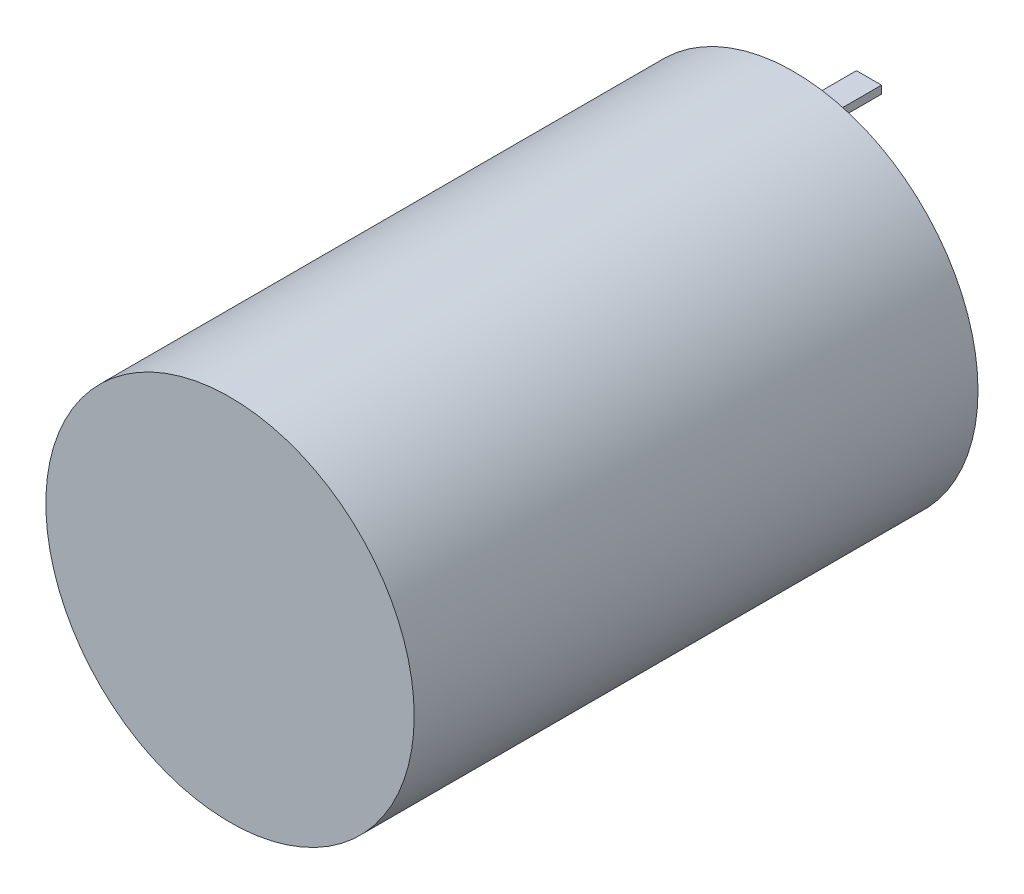
ISO-10303-21;
HEADER;
FILE_DESCRIPTION(('STEP AP214'),'2;1');
FILE_NAME('part.step','',(''),(''),'','','');
FILE_SCHEMA(('AUTOMOTIVE_DESIGN { 1 0 10303 214 1 1 1 1 }'));
ENDSEC;
DATA;
#1=APPLICATION_CONTEXT('core data for automotive mechanical design processes');
#2=APPLICATION_PROTOCOL_DEFINITION('international standard','automotive_design',2000,#1);
#3=PRODUCT_CONTEXT('',#1,'mechanical');
#4=PRODUCT('Part','Part','',(#3));
#5=PRODUCT_RELATED_PRODUCT_CATEGORY('part','',(#4));
#6=PRODUCT_DEFINITION_FORMATION('','',#4);
#7=PRODUCT_DEFINITION_CONTEXT('part definition',#1,'design');
#8=PRODUCT_DEFINITION('design','',#6,#7);
#9=PRODUCT_DEFINITION_SHAPE('','',#8);
#10=(LENGTH_UNIT() NAMED_UNIT(*) SI_UNIT(.MILLI.,.METRE.));
#11=(NAMED_UNIT(*) PLANE_ANGLE_UNIT() SI_UNIT($,.RADIAN.));
#12=(NAMED_UNIT(*) SI_UNIT($,.STERADIAN.) SOLID_ANGLE_UNIT());
#13=UNCERTAINTY_MEASURE_WITH_UNIT(LENGTH_MEASURE(1.E-05),#10,'distance_accuracy_value','');
#14=(GEOMETRIC_REPRESENTATION_CONTEXT(3) GLOBAL_UNCERTAINTY_ASSIGNED_CONTEXT((#13)) GLOBAL_UNIT_ASSIGNED_CONTEXT((#10,
#11,#12)) REPRESENTATION_CONTEXT('',''));
#15=CARTESIAN_POINT('',(0.,0.,0.));
#16=DIRECTION('',(0.,0.,1.));
#17=DIRECTION('',(1.,0.,0.));
#18=AXIS2_PLACEMENT_3D('',#15,#16,#17);
#19=CARTESIAN_POINT('',(0.,0.,57.15));
#20=DIRECTION('',(0.,0.,-1.));
#21=DIRECTION('',(-1.,0.,0.));
#22=AXIS2_PLACEMENT_3D('',#19,#20,#21);
#23=CYLINDRICAL_SURFACE('',#22,18.669);
#24=CARTESIAN_POINT('',(0.,0.,57.15));
#25=DIRECTION('',(0.,0.,1.));
#26=DIRECTION('',(1.,0.,0.));
#27=AXIS2_PLACEMENT_3D('',#24,#25,#26);
#28=CIRCLE('',#27,18.669);
#29=CARTESIAN_POINT('',(18.669,0.,57.15));
#30=VERTEX_POINT('',#29);
#31=EDGE_CURVE('E13',#30,#30,#28,.T.);
#32=ORIENTED_EDGE('',*,*,#31,.F.);
#33=EDGE_LOOP('',(#32));
#34=FACE_BOUND('',#33,.T.);
#35=CARTESIAN_POINT('',(0.,0.,0.));
#36=DIRECTION('',(0.,0.,1.));
#37=DIRECTION('',(1.,0.,0.));
#38=AXIS2_PLACEMENT_3D('',#35,#36,#37);
#39=CIRCLE('',#38,18.669);
#40=CARTESIAN_POINT('',(18.669,0.,0.));
#41=VERTEX_POINT('',#40);
#42=EDGE_CURVE('E52',#41,#41,#39,.T.);
#43=ORIENTED_EDGE('',*,*,#42,.T.);
#44=EDGE_LOOP('',(#43));
#45=FACE_BOUND('',#44,.T.);
#46=ADVANCED_FACE('F49',(#34,#45),#23,.T.);
#47=CARTESIAN_POINT('',(0.,0.,57.15));
#48=DIRECTION('',(0.,0.,1.));
#49=DIRECTION('',(1.,0.,0.));
#50=AXIS2_PLACEMENT_3D('',#47,#48,#49);
#51=PLANE('',#50);
#52=ORIENTED_EDGE('',*,*,#31,.T.);
#53=EDGE_LOOP('',(#52));
#54=FACE_BOUND('',#53,.T.);
#55=ADVANCED_FACE('F190',(#54),#51,.T.);
#56=CARTESIAN_POINT('',(0.,0.,0.));
#57=DIRECTION('',(0.,0.,1.));
#58=DIRECTION('',(1.,0.,0.));
#59=AXIS2_PLACEMENT_3D('',#56,#57,#58);
#60=PLANE('',#59);
#61=DIRECTION('',(-1.,0.,0.));
#62=VECTOR('',#61,1.);
#63=CARTESIAN_POINT('',(0.,-13.509625,0.));
#64=LINE('',#63,#62);
#65=CARTESIAN_POINT('',(1.27,-13.509625,0.));
#66=VERTEX_POINT('',#65);
#67=CARTESIAN_POINT('',(-1.27,-13.509625,0.));
#68=VERTEX_POINT('',#67);
#69=EDGE_CURVE('E63',#66,#68,#64,.T.);
#70=ORIENTED_EDGE('',*,*,#69,.T.);
#71=DIRECTION('',(0.,-1.,0.));
#72=VECTOR('',#71,1.);
#73=CARTESIAN_POINT('',(-1.26999999999999,0.,0.));
#74=LINE('',#73,#72);
#75=CARTESIAN_POINT('',(-1.27,-14.303375,0.));
#76=VERTEX_POINT('',#75);
#77=EDGE_CURVE('E117',#68,#76,#74,.T.);
#78=ORIENTED_EDGE('',*,*,#77,.T.);
#79=DIRECTION('',(-1.,0.,0.));
#80=VECTOR('',#79,1.);
#81=CARTESIAN_POINT('',(0.,-14.303375,0.));
#82=LINE('',#81,#80);
#83=CARTESIAN_POINT('',(1.27,-14.303375,0.));
#84=VERTEX_POINT('',#83);
#85=EDGE_CURVE('E130',#84,#76,#82,.T.);
#86=ORIENTED_EDGE('',*,*,#85,.F.);
#87=DIRECTION('',(0.,-1.,0.));
#88=VECTOR('',#87,1.);
#89=CARTESIAN_POINT('',(1.27,0.,0.));
#90=LINE('',#89,#88);
#91=EDGE_CURVE('E68',#66,#84,#90,.T.);
#92=ORIENTED_EDGE('',*,*,#91,.F.);
#93=EDGE_LOOP('',(#70,#78,#86,#92));
#94=FACE_BOUND('',#93,.T.);
#95=DIRECTION('',(-1.,0.,0.));
#96=VECTOR('',#95,1.);
#97=CARTESIAN_POINT('',(0.,14.303375,0.));
#98=LINE('',#97,#96);
#99=CARTESIAN_POINT('',(1.27,14.303375,0.));
#100=VERTEX_POINT('',#99);
#101=CARTESIAN_POINT('',(-1.27,14.303375,0.));
#102=VERTEX_POINT('',#101);
#103=EDGE_CURVE('E163',#100,#102,#98,.T.);
#104=ORIENTED_EDGE('',*,*,#103,.T.);
#105=DIRECTION('',(0.,-1.,0.));
#106=VECTOR('',#105,1.);
#107=CARTESIAN_POINT('',(-1.27,0.,0.));
#108=LINE('',#107,#106);
#109=CARTESIAN_POINT('',(-1.27,13.509625,0.));
#110=VERTEX_POINT('',#109);
#111=EDGE_CURVE('E120',#102,#110,#108,.T.);
#112=ORIENTED_EDGE('',*,*,#111,.T.);
#113=DIRECTION('',(-1.,0.,0.));
#114=VECTOR('',#113,1.);
#115=CARTESIAN_POINT('',(0.,13.509625,0.));
#116=LINE('',#115,#114);
#117=CARTESIAN_POINT('',(1.27,13.509625,0.));
#118=VERTEX_POINT('',#117);
#119=EDGE_CURVE('E154',#118,#110,#116,.T.);
#120=ORIENTED_EDGE('',*,*,#119,.F.);
#121=DIRECTION('',(0.,-1.,0.));
#122=VECTOR('',#121,1.);
#123=CARTESIAN_POINT('',(1.27,0.,0.));
#124=LINE('',#123,#122);
#125=EDGE_CURVE('E165',#100,#118,#124,.T.);
#126=ORIENTED_EDGE('',*,*,#125,.F.);
#127=EDGE_LOOP('',(#104,#112,#120,#126));
#128=FACE_BOUND('',#127,.T.);
#129=ORIENTED_EDGE('',*,*,#42,.F.);
#130=EDGE_LOOP('',(#129));
#131=FACE_BOUND('',#130,.T.);
#132=ADVANCED_FACE('F187',(#94,#128,#131),#60,.F.);
#133=CARTESIAN_POINT('',(-1.27,0.,-7.62));
#134=DIRECTION('',(-1.,0.,0.));
#135=DIRECTION('',(0.,0.,1.));
#136=AXIS2_PLACEMENT_3D('',#133,#134,#135);
#137=PLANE('',#136);
#138=ORIENTED_EDGE('',*,*,#111,.F.);
#139=DIRECTION('',(0.,0.,1.));
#140=VECTOR('',#139,1.);
#141=CARTESIAN_POINT('',(-1.27,14.303375,-7.62));
#142=LINE('',#141,#140);
#143=CARTESIAN_POINT('',(-1.27,14.303375,-7.62));
#144=VERTEX_POINT('',#143);
#145=EDGE_CURVE('E178',#144,#102,#142,.T.);
#146=ORIENTED_EDGE('',*,*,#145,.F.);
#147=DIRECTION('',(0.,-1.,0.));
#148=VECTOR('',#147,1.);
#149=CARTESIAN_POINT('',(-1.27,0.,-7.62));
#150=LINE('',#149,#148);
#151=CARTESIAN_POINT('',(-1.27,13.509625,-7.62));
#152=VERTEX_POINT('',#151);
#153=EDGE_CURVE('E150',#144,#152,#150,.T.);
#154=ORIENTED_EDGE('',*,*,#153,.T.);
#155=DIRECTION('',(0.,0.,1.));
#156=VECTOR('',#155,1.);
#157=CARTESIAN_POINT('',(-1.27,13.509625,-7.62));
#158=LINE('',#157,#156);
#159=EDGE_CURVE('E161',#152,#110,#158,.T.);
#160=ORIENTED_EDGE('',*,*,#159,.T.);
#161=EDGE_LOOP('',(#138,#146,#154,#160));
#162=FACE_BOUND('',#161,.T.);
#163=ADVANCED_FACE('F189',(#162),#137,.T.);
#164=CARTESIAN_POINT('',(0.,14.303375,-7.62));
#165=DIRECTION('',(0.,1.,0.));
#166=DIRECTION('',(0.,0.,1.));
#167=AXIS2_PLACEMENT_3D('',#164,#165,#166);
#168=PLANE('',#167);
#169=ORIENTED_EDGE('',*,*,#103,.F.);
#170=DIRECTION('',(0.,0.,1.));
#171=VECTOR('',#170,1.);
#172=CARTESIAN_POINT('',(1.27,14.303375,-7.62));
#173=LINE('',#172,#171);
#174=CARTESIAN_POINT('',(1.27,14.303375,-7.62));
#175=VERTEX_POINT('',#174);
#176=EDGE_CURVE('E175',#175,#100,#173,.T.);
#177=ORIENTED_EDGE('',*,*,#176,.F.);
#178=DIRECTION('',(-1.,0.,0.));
#179=VECTOR('',#178,1.);
#180=CARTESIAN_POINT('',(0.,14.303375,-7.62));
#181=LINE('',#180,#179);
#182=EDGE_CURVE('E153',#175,#144,#181,.T.);
#183=ORIENTED_EDGE('',*,*,#182,.T.);
#184=ORIENTED_EDGE('',*,*,#145,.T.);
#185=EDGE_LOOP('',(#169,#177,#183,#184));
#186=FACE_BOUND('',#185,.T.);
#187=ADVANCED_FACE('F195',(#186),#168,.T.);
#188=CARTESIAN_POINT('',(1.27,0.,-7.62));
#189=DIRECTION('',(-1.,0.,0.));
#190=DIRECTION('',(0.,0.,1.));
#191=AXIS2_PLACEMENT_3D('',#188,#189,#190);
#192=PLANE('',#191);
#193=ORIENTED_EDGE('',*,*,#125,.T.);
#194=DIRECTION('',(0.,0.,1.));
#195=VECTOR('',#194,1.);
#196=CARTESIAN_POINT('',(1.27,13.509625,-7.62));
#197=LINE('',#196,#195);
#198=CARTESIAN_POINT('',(1.27,13.509625,-7.62));
#199=VERTEX_POINT('',#198);
#200=EDGE_CURVE('E172',#199,#118,#197,.T.);
#201=ORIENTED_EDGE('',*,*,#200,.F.);
#202=DIRECTION('',(0.,-1.,0.));
#203=VECTOR('',#202,1.);
#204=CARTESIAN_POINT('',(1.27,0.,-7.62));
#205=LINE('',#204,#203);
#206=EDGE_CURVE('E157',#175,#199,#205,.T.);
#207=ORIENTED_EDGE('',*,*,#206,.F.);
#208=ORIENTED_EDGE('',*,*,#176,.T.);
#209=EDGE_LOOP('',(#193,#201,#207,#208));
#210=FACE_BOUND('',#209,.T.);
#211=ADVANCED_FACE('F229',(#210),#192,.F.);
#212=CARTESIAN_POINT('',(0.,13.509625,-7.62));
#213=DIRECTION('',(0.,1.,0.));
#214=DIRECTION('',(0.,0.,1.));
#215=AXIS2_PLACEMENT_3D('',#212,#213,#214);
#216=PLANE('',#215);
#217=ORIENTED_EDGE('',*,*,#119,.T.);
#218=ORIENTED_EDGE('',*,*,#159,.F.);
#219=DIRECTION('',(-1.,0.,0.));
#220=VECTOR('',#219,1.);
#221=CARTESIAN_POINT('',(0.,13.509625,-7.62));
#222=LINE('',#221,#220);
#223=EDGE_CURVE('E159',#199,#152,#222,.T.);
#224=ORIENTED_EDGE('',*,*,#223,.F.);
#225=ORIENTED_EDGE('',*,*,#200,.T.);
#226=EDGE_LOOP('',(#217,#218,#224,#225));
#227=FACE_BOUND('',#226,.T.);
#228=ADVANCED_FACE('F238',(#227),#216,.F.);
#229=CARTESIAN_POINT('',(0.,0.,-7.62));
#230=DIRECTION('',(0.,0.,-1.));
#231=DIRECTION('',(-1.,0.,0.));
#232=AXIS2_PLACEMENT_3D('',#229,#230,#231);
#233=PLANE('',#232);
#234=ORIENTED_EDGE('',*,*,#153,.F.);
#235=ORIENTED_EDGE('',*,*,#182,.F.);
#236=ORIENTED_EDGE('',*,*,#206,.T.);
#237=ORIENTED_EDGE('',*,*,#223,.T.);
#238=EDGE_LOOP('',(#234,#235,#236,#237));
#239=FACE_BOUND('',#238,.T.);
#240=ADVANCED_FACE('F248',(#239),#233,.T.);
#241=CARTESIAN_POINT('',(-1.26999999999999,0.,-7.62));
#242=DIRECTION('',(-1.,0.,0.));
#243=DIRECTION('',(0.,-1.,0.));
#244=AXIS2_PLACEMENT_3D('',#241,#242,#243);
#245=PLANE('',#244);
#246=ORIENTED_EDGE('',*,*,#77,.F.);
#247=DIRECTION('',(0.,0.,1.));
#248=VECTOR('',#247,1.);
#249=CARTESIAN_POINT('',(-1.27,-13.509625,-7.62));
#250=LINE('',#249,#248);
#251=CARTESIAN_POINT('',(-1.27,-13.509625,-7.62));
#252=VERTEX_POINT('',#251);
#253=EDGE_CURVE('E112',#252,#68,#250,.T.);
#254=ORIENTED_EDGE('',*,*,#253,.F.);
#255=DIRECTION('',(0.,-1.,0.));
#256=VECTOR('',#255,1.);
#257=CARTESIAN_POINT('',(-1.26999999999999,0.,-7.62));
#258=LINE('',#257,#256);
#259=CARTESIAN_POINT('',(-1.27,-14.303375,-7.62));
#260=VERTEX_POINT('',#259);
#261=EDGE_CURVE('E116',#252,#260,#258,.T.);
#262=ORIENTED_EDGE('',*,*,#261,.T.);
#263=DIRECTION('',(0.,0.,1.));
#264=VECTOR('',#263,1.);
#265=CARTESIAN_POINT('',(-1.27,-14.303375,-7.62));
#266=LINE('',#265,#264);
#267=EDGE_CURVE('E139',#260,#76,#266,.T.);
#268=ORIENTED_EDGE('',*,*,#267,.T.);
#269=EDGE_LOOP('',(#246,#254,#262,#268));
#270=FACE_BOUND('',#269,.T.);
#271=ADVANCED_FACE('F114',(#270),#245,.T.);
#272=CARTESIAN_POINT('',(0.,-13.509625,-7.62));
#273=DIRECTION('',(0.,1.,0.));
#274=DIRECTION('',(0.,0.,1.));
#275=AXIS2_PLACEMENT_3D('',#272,#273,#274);
#276=PLANE('',#275);
#277=ORIENTED_EDGE('',*,*,#69,.F.);
#278=DIRECTION('',(0.,0.,1.));
#279=VECTOR('',#278,1.);
#280=CARTESIAN_POINT('',(1.27,-13.509625,-7.62));
#281=LINE('',#280,#279);
#282=CARTESIAN_POINT('',(1.27,-13.509625,-7.62));
#283=VERTEX_POINT('',#282);
#284=EDGE_CURVE('E121',#283,#66,#281,.T.);
#285=ORIENTED_EDGE('',*,*,#284,.F.);
#286=DIRECTION('',(-1.,0.,0.));
#287=VECTOR('',#286,1.);
#288=CARTESIAN_POINT('',(0.,-13.509625,-7.62));
#289=LINE('',#288,#287);
#290=EDGE_CURVE('E126',#283,#252,#289,.T.);
#291=ORIENTED_EDGE('',*,*,#290,.T.);
#292=ORIENTED_EDGE('',*,*,#253,.T.);
#293=EDGE_LOOP('',(#277,#285,#291,#292));
#294=FACE_BOUND('',#293,.T.);
#295=ADVANCED_FACE('F132',(#294),#276,.T.);
#296=CARTESIAN_POINT('',(1.27,0.,-7.62));
#297=DIRECTION('',(-1.,0.,0.));
#298=DIRECTION('',(0.,0.,1.));
#299=AXIS2_PLACEMENT_3D('',#296,#297,#298);
#300=PLANE('',#299);
#301=ORIENTED_EDGE('',*,*,#91,.T.);
#302=DIRECTION('',(0.,0.,1.));
#303=VECTOR('',#302,1.);
#304=CARTESIAN_POINT('',(1.27,-14.303375,-7.62));
#305=LINE('',#304,#303);
#306=CARTESIAN_POINT('',(1.27,-14.303375,-7.62));
#307=VERTEX_POINT('',#306);
#308=EDGE_CURVE('E146',#307,#84,#305,.T.);
#309=ORIENTED_EDGE('',*,*,#308,.F.);
#310=DIRECTION('',(0.,-1.,0.));
#311=VECTOR('',#310,1.);
#312=CARTESIAN_POINT('',(1.27,0.,-7.62));
#313=LINE('',#312,#311);
#314=EDGE_CURVE('E134',#283,#307,#313,.T.);
#315=ORIENTED_EDGE('',*,*,#314,.F.);
#316=ORIENTED_EDGE('',*,*,#284,.T.);
#317=EDGE_LOOP('',(#301,#309,#315,#316));
#318=FACE_BOUND('',#317,.T.);
#319=ADVANCED_FACE('F275',(#318),#300,.F.);
#320=CARTESIAN_POINT('',(0.,-14.303375,-7.62));
#321=DIRECTION('',(0.,1.,0.));
#322=DIRECTION('',(0.,0.,1.));
#323=AXIS2_PLACEMENT_3D('',#320,#321,#322);
#324=PLANE('',#323);
#325=ORIENTED_EDGE('',*,*,#85,.T.);
#326=ORIENTED_EDGE('',*,*,#267,.F.);
#327=DIRECTION('',(-1.,0.,0.));
#328=VECTOR('',#327,1.);
#329=CARTESIAN_POINT('',(0.,-14.303375,-7.62));
#330=LINE('',#329,#328);
#331=EDGE_CURVE('E128',#307,#260,#330,.T.);
#332=ORIENTED_EDGE('',*,*,#331,.F.);
#333=ORIENTED_EDGE('',*,*,#308,.T.);
#334=EDGE_LOOP('',(#325,#326,#332,#333));
#335=FACE_BOUND('',#334,.T.);
#336=ADVANCED_FACE('F284',(#335),#324,.F.);
#337=CARTESIAN_POINT('',(0.,0.,-7.62));
#338=DIRECTION('',(0.,0.,-1.));
#339=DIRECTION('',(-1.,0.,0.));
#340=AXIS2_PLACEMENT_3D('',#337,#338,#339);
#341=PLANE('',#340);
#342=ORIENTED_EDGE('',*,*,#261,.F.);
#343=ORIENTED_EDGE('',*,*,#290,.F.);
#344=ORIENTED_EDGE('',*,*,#314,.T.);
#345=ORIENTED_EDGE('',*,*,#331,.T.);
#346=EDGE_LOOP('',(#342,#343,#344,#345));
#347=FACE_BOUND('',#346,.T.);
#348=ADVANCED_FACE('F125',(#347),#341,.T.);
#349=CLOSED_SHELL('',(#46,#55,#132,#163,#187,#211,#228,#240,#271,#295,#319,#336,#348));
#350=MANIFOLD_SOLID_BREP('B2',#349);
#351=ADVANCED_BREP_SHAPE_REPRESENTATION('',(#18,#350),#14);
#352=SHAPE_DEFINITION_REPRESENTATION(#9,#351);
ENDSEC;
END-ISO-10303-21;
